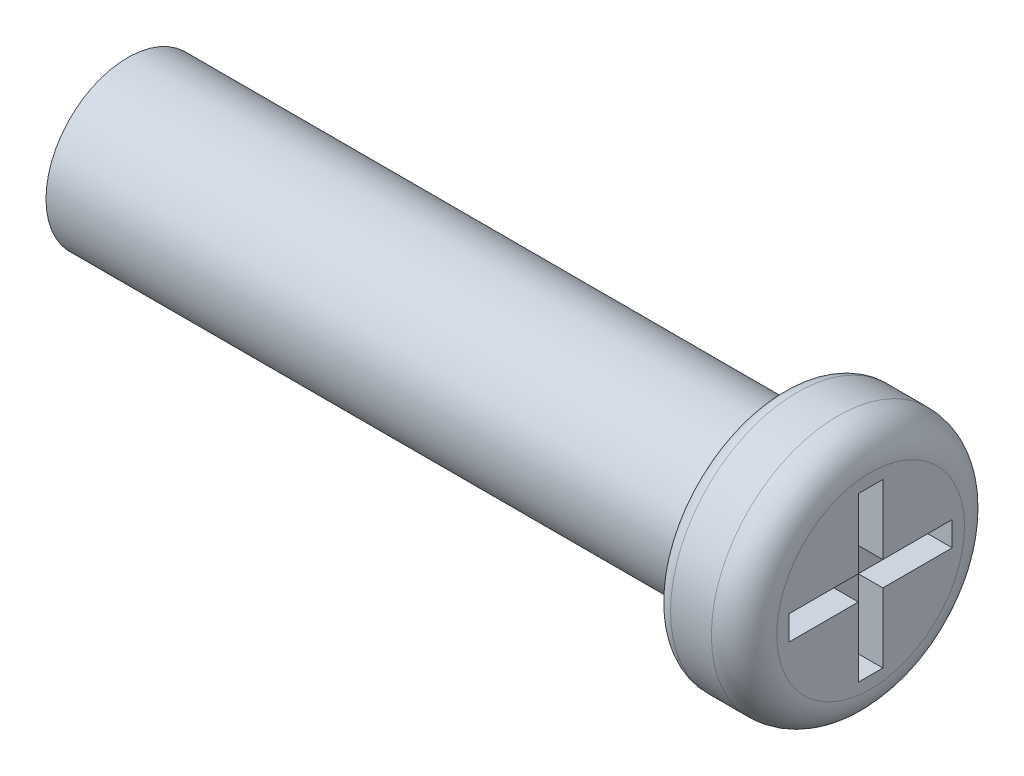
ISO-10303-21;
HEADER;
FILE_DESCRIPTION(('STEP AP214'),'2;1');
FILE_NAME('part.step','',(''),(''),'','','');
FILE_SCHEMA(('AUTOMOTIVE_DESIGN { 1 0 10303 214 1 1 1 1 }'));
ENDSEC;
DATA;
#1=APPLICATION_CONTEXT('core data for automotive mechanical design processes');
#2=APPLICATION_PROTOCOL_DEFINITION('international standard','automotive_design',2000,#1);
#3=PRODUCT_CONTEXT('',#1,'mechanical');
#4=PRODUCT('Part','Part','',(#3));
#5=PRODUCT_RELATED_PRODUCT_CATEGORY('part','',(#4));
#6=PRODUCT_DEFINITION_FORMATION('','',#4);
#7=PRODUCT_DEFINITION_CONTEXT('part definition',#1,'design');
#8=PRODUCT_DEFINITION('design','',#6,#7);
#9=PRODUCT_DEFINITION_SHAPE('','',#8);
#10=(LENGTH_UNIT() NAMED_UNIT(*) SI_UNIT(.MILLI.,.METRE.));
#11=(NAMED_UNIT(*) PLANE_ANGLE_UNIT() SI_UNIT($,.RADIAN.));
#12=(NAMED_UNIT(*) SI_UNIT($,.STERADIAN.) SOLID_ANGLE_UNIT());
#13=UNCERTAINTY_MEASURE_WITH_UNIT(LENGTH_MEASURE(1.E-05),#10,'distance_accuracy_value','');
#14=(GEOMETRIC_REPRESENTATION_CONTEXT(3) GLOBAL_UNCERTAINTY_ASSIGNED_CONTEXT((#13)) GLOBAL_UNIT_ASSIGNED_CONTEXT((#10,
#11,#12)) REPRESENTATION_CONTEXT('',''));
#15=CARTESIAN_POINT('',(0.,0.,0.));
#16=DIRECTION('',(0.,0.,1.));
#17=DIRECTION('',(1.,0.,0.));
#18=AXIS2_PLACEMENT_3D('',#15,#16,#17);
#19=CARTESIAN_POINT('',(26.1,0.,0.));
#20=DIRECTION('',(1.,0.,0.));
#21=DIRECTION('',(0.,0.,-1.));
#22=AXIS2_PLACEMENT_3D('',#19,#20,#21);
#23=PLANE('',#22);
#24=CARTESIAN_POINT('',(26.1,0.,0.));
#25=DIRECTION('',(1.,0.,0.));
#26=DIRECTION('',(0.,0.,-1.));
#27=AXIS2_PLACEMENT_3D('',#24,#25,#26);
#28=CIRCLE('',#27,1.15);
#29=CARTESIAN_POINT('',(26.1,0.,-1.15));
#30=VERTEX_POINT('',#29);
#31=EDGE_CURVE('E216',#30,#30,#28,.T.);
#32=ORIENTED_EDGE('',*,*,#31,.T.);
#33=EDGE_LOOP('',(#32));
#34=FACE_BOUND('',#33,.T.);
#35=DIRECTION('',(0.,-1.,0.));
#36=VECTOR('',#35,1.);
#37=CARTESIAN_POINT('',(26.1,0.,-1.));
#38=LINE('',#37,#36);
#39=CARTESIAN_POINT('',(26.1,0.15,-1.));
#40=VERTEX_POINT('',#39);
#41=CARTESIAN_POINT('',(26.1,-0.15,-1.));
#42=VERTEX_POINT('',#41);
#43=EDGE_CURVE('E162',#40,#42,#38,.T.);
#44=ORIENTED_EDGE('',*,*,#43,.T.);
#45=DIRECTION('',(0.,0.,1.));
#46=VECTOR('',#45,1.);
#47=CARTESIAN_POINT('',(26.1,-0.15,0.));
#48=LINE('',#47,#46);
#49=CARTESIAN_POINT('',(26.1,-0.15,-0.15));
#50=VERTEX_POINT('',#49);
#51=EDGE_CURVE('E49',#42,#50,#48,.T.);
#52=ORIENTED_EDGE('',*,*,#51,.T.);
#53=DIRECTION('',(0.,-1.,0.));
#54=VECTOR('',#53,1.);
#55=CARTESIAN_POINT('',(26.1,0.,-0.15));
#56=LINE('',#55,#54);
#57=CARTESIAN_POINT('',(26.1,-1.,-0.15));
#58=VERTEX_POINT('',#57);
#59=EDGE_CURVE('E99',#50,#58,#56,.T.);
#60=ORIENTED_EDGE('',*,*,#59,.T.);
#61=DIRECTION('',(0.,0.,1.));
#62=VECTOR('',#61,1.);
#63=CARTESIAN_POINT('',(26.1,-1.,0.));
#64=LINE('',#63,#62);
#65=CARTESIAN_POINT('',(26.1,-1.,0.15));
#66=VERTEX_POINT('',#65);
#67=EDGE_CURVE('E187',#58,#66,#64,.T.);
#68=ORIENTED_EDGE('',*,*,#67,.T.);
#69=DIRECTION('',(0.,-1.,0.));
#70=VECTOR('',#69,1.);
#71=CARTESIAN_POINT('',(26.1,0.,0.15));
#72=LINE('',#71,#70);
#73=CARTESIAN_POINT('',(26.1,-0.15,0.15));
#74=VERTEX_POINT('',#73);
#75=EDGE_CURVE('E146',#74,#66,#72,.T.);
#76=ORIENTED_EDGE('',*,*,#75,.F.);
#77=DIRECTION('',(0.,0.,1.));
#78=VECTOR('',#77,1.);
#79=CARTESIAN_POINT('',(26.1,-0.15,0.));
#80=LINE('',#79,#78);
#81=CARTESIAN_POINT('',(26.1,-0.15,1.));
#82=VERTEX_POINT('',#81);
#83=EDGE_CURVE('E183',#74,#82,#80,.T.);
#84=ORIENTED_EDGE('',*,*,#83,.T.);
#85=DIRECTION('',(0.,-1.,0.));
#86=VECTOR('',#85,1.);
#87=CARTESIAN_POINT('',(26.1,0.,1.));
#88=LINE('',#87,#86);
#89=CARTESIAN_POINT('',(26.1,0.15,1.));
#90=VERTEX_POINT('',#89);
#91=EDGE_CURVE('E180',#90,#82,#88,.T.);
#92=ORIENTED_EDGE('',*,*,#91,.F.);
#93=DIRECTION('',(0.,0.,1.));
#94=VECTOR('',#93,1.);
#95=CARTESIAN_POINT('',(26.1,0.15,0.));
#96=LINE('',#95,#94);
#97=CARTESIAN_POINT('',(26.1,0.15,0.15));
#98=VERTEX_POINT('',#97);
#99=EDGE_CURVE('E177',#98,#90,#96,.T.);
#100=ORIENTED_EDGE('',*,*,#99,.F.);
#101=DIRECTION('',(0.,-1.,0.));
#102=VECTOR('',#101,1.);
#103=CARTESIAN_POINT('',(26.1,0.,0.15));
#104=LINE('',#103,#102);
#105=CARTESIAN_POINT('',(26.1,1.,0.15));
#106=VERTEX_POINT('',#105);
#107=EDGE_CURVE('E174',#106,#98,#104,.T.);
#108=ORIENTED_EDGE('',*,*,#107,.F.);
#109=DIRECTION('',(0.,0.,1.));
#110=VECTOR('',#109,1.);
#111=CARTESIAN_POINT('',(26.1,1.,0.));
#112=LINE('',#111,#110);
#113=CARTESIAN_POINT('',(26.1,1.,-0.15));
#114=VERTEX_POINT('',#113);
#115=EDGE_CURVE('E171',#114,#106,#112,.T.);
#116=ORIENTED_EDGE('',*,*,#115,.F.);
#117=DIRECTION('',(0.,-1.,0.));
#118=VECTOR('',#117,1.);
#119=CARTESIAN_POINT('',(26.1,0.,-0.15));
#120=LINE('',#119,#118);
#121=CARTESIAN_POINT('',(26.1,0.15,-0.15));
#122=VERTEX_POINT('',#121);
#123=EDGE_CURVE('E168',#114,#122,#120,.T.);
#124=ORIENTED_EDGE('',*,*,#123,.T.);
#125=DIRECTION('',(0.,0.,1.));
#126=VECTOR('',#125,1.);
#127=CARTESIAN_POINT('',(26.1,0.15,0.));
#128=LINE('',#127,#126);
#129=EDGE_CURVE('E165',#40,#122,#128,.T.);
#130=ORIENTED_EDGE('',*,*,#129,.F.);
#131=EDGE_LOOP('',(#44,#52,#60,#68,#76,#84,#92,#100,#108,#116,#124,#130));
#132=FACE_BOUND('',#131,.T.);
#133=ADVANCED_FACE('F34',(#34,#132),#23,.T.);
#134=CARTESIAN_POINT('',(25.,0.,0.));
#135=DIRECTION('',(-1.,0.,0.));
#136=DIRECTION('',(0.,0.,1.));
#137=AXIS2_PLACEMENT_3D('',#134,#135,#136);
#138=CYLINDRICAL_SURFACE('',#137,1.);
#139=CARTESIAN_POINT('',(25.,0.,0.));
#140=DIRECTION('',(1.,0.,0.));
#141=DIRECTION('',(0.,0.,-1.));
#142=AXIS2_PLACEMENT_3D('',#139,#140,#141);
#143=CIRCLE('',#142,1.);
#144=CARTESIAN_POINT('',(25.,0.,-1.));
#145=VERTEX_POINT('',#144);
#146=EDGE_CURVE('E213',#145,#145,#143,.T.);
#147=ORIENTED_EDGE('',*,*,#146,.F.);
#148=EDGE_LOOP('',(#147));
#149=FACE_BOUND('',#148,.T.);
#150=CARTESIAN_POINT('',(17.,0.,0.));
#151=DIRECTION('',(-1.,0.,0.));
#152=DIRECTION('',(0.,0.,1.));
#153=AXIS2_PLACEMENT_3D('',#150,#151,#152);
#154=CIRCLE('',#153,1.);
#155=CARTESIAN_POINT('',(17.,0.,1.));
#156=VERTEX_POINT('',#155);
#157=EDGE_CURVE('E193',#156,#156,#154,.T.);
#158=ORIENTED_EDGE('',*,*,#157,.F.);
#159=EDGE_LOOP('',(#158));
#160=FACE_BOUND('',#159,.T.);
#161=ADVANCED_FACE('F236',(#149,#160),#138,.T.);
#162=CARTESIAN_POINT('',(26.1,0.,0.));
#163=DIRECTION('',(-1.,0.,0.));
#164=DIRECTION('',(0.,0.,1.));
#165=AXIS2_PLACEMENT_3D('',#162,#163,#164);
#166=CYLINDRICAL_SURFACE('',#165,1.55);
#167=CARTESIAN_POINT('',(25.2,0.,0.));
#168=DIRECTION('',(1.,0.,0.));
#169=DIRECTION('',(0.,0.,-1.));
#170=AXIS2_PLACEMENT_3D('',#167,#168,#169);
#171=CIRCLE('',#170,1.55);
#172=CARTESIAN_POINT('',(25.2,0.,-1.55));
#173=VERTEX_POINT('',#172);
#174=EDGE_CURVE('E42',#173,#173,#171,.T.);
#175=ORIENTED_EDGE('',*,*,#174,.T.);
#176=EDGE_LOOP('',(#175));
#177=FACE_BOUND('',#176,.T.);
#178=CARTESIAN_POINT('',(25.7,0.,0.));
#179=DIRECTION('',(1.,0.,0.));
#180=DIRECTION('',(0.,0.,-1.));
#181=AXIS2_PLACEMENT_3D('',#178,#179,#180);
#182=CIRCLE('',#181,1.55);
#183=CARTESIAN_POINT('',(25.7,0.,-1.55));
#184=VERTEX_POINT('',#183);
#185=EDGE_CURVE('E219',#184,#184,#182,.F.);
#186=ORIENTED_EDGE('',*,*,#185,.T.);
#187=EDGE_LOOP('',(#186));
#188=FACE_BOUND('',#187,.T.);
#189=ADVANCED_FACE('F224',(#177,#188),#166,.T.);
#190=CARTESIAN_POINT('',(25.,0.,0.));
#191=DIRECTION('',(1.,0.,0.));
#192=DIRECTION('',(0.,0.,-1.));
#193=AXIS2_PLACEMENT_3D('',#190,#191,#192);
#194=PLANE('',#193);
#195=CARTESIAN_POINT('',(25.,0.,0.));
#196=DIRECTION('',(1.,0.,0.));
#197=DIRECTION('',(0.,0.,-1.));
#198=AXIS2_PLACEMENT_3D('',#195,#196,#197);
#199=CIRCLE('',#198,1.35);
#200=CARTESIAN_POINT('',(25.,0.,-1.35));
#201=VERTEX_POINT('',#200);
#202=EDGE_CURVE('E11',#201,#201,#199,.F.);
#203=ORIENTED_EDGE('',*,*,#202,.T.);
#204=EDGE_LOOP('',(#203));
#205=FACE_BOUND('',#204,.T.);
#206=ORIENTED_EDGE('',*,*,#146,.T.);
#207=EDGE_LOOP('',(#206));
#208=FACE_BOUND('',#207,.T.);
#209=ADVANCED_FACE('F249',(#205,#208),#194,.F.);
#210=CARTESIAN_POINT('',(17.,0.,0.));
#211=DIRECTION('',(-1.,0.,0.));
#212=DIRECTION('',(0.,0.,1.));
#213=AXIS2_PLACEMENT_3D('',#210,#211,#212);
#214=PLANE('',#213);
#215=ORIENTED_EDGE('',*,*,#157,.T.);
#216=EDGE_LOOP('',(#215));
#217=FACE_BOUND('',#216,.T.);
#218=ADVANCED_FACE('F247',(#217),#214,.T.);
#219=CARTESIAN_POINT('',(25.8,-0.15,0.));
#220=DIRECTION('',(0.,1.,0.));
#221=DIRECTION('',(0.,0.,1.));
#222=AXIS2_PLACEMENT_3D('',#219,#220,#221);
#223=PLANE('',#222);
#224=ORIENTED_EDGE('',*,*,#51,.F.);
#225=DIRECTION('',(1.,0.,0.));
#226=VECTOR('',#225,1.);
#227=CARTESIAN_POINT('',(25.8,-0.15,-1.));
#228=LINE('',#227,#226);
#229=CARTESIAN_POINT('',(25.8,-0.15,-1.));
#230=VERTEX_POINT('',#229);
#231=EDGE_CURVE('E160',#230,#42,#228,.T.);
#232=ORIENTED_EDGE('',*,*,#231,.F.);
#233=DIRECTION('',(0.,0.,1.));
#234=VECTOR('',#233,1.);
#235=CARTESIAN_POINT('',(25.8,-0.15,0.));
#236=LINE('',#235,#234);
#237=CARTESIAN_POINT('',(25.8,-0.15,-0.15));
#238=VERTEX_POINT('',#237);
#239=EDGE_CURVE('E190',#230,#238,#236,.T.);
#240=ORIENTED_EDGE('',*,*,#239,.T.);
#241=DIRECTION('',(1.,0.,0.));
#242=VECTOR('',#241,1.);
#243=CARTESIAN_POINT('',(25.8,-0.15,-0.15));
#244=LINE('',#243,#242);
#245=EDGE_CURVE('E191',#238,#50,#244,.T.);
#246=ORIENTED_EDGE('',*,*,#245,.T.);
#247=EDGE_LOOP('',(#224,#232,#240,#246));
#248=FACE_BOUND('',#247,.T.);
#249=ADVANCED_FACE('F269',(#248),#223,.T.);
#250=CARTESIAN_POINT('',(25.8,0.,-0.15));
#251=DIRECTION('',(0.,0.,1.));
#252=DIRECTION('',(0.,-1.,0.));
#253=AXIS2_PLACEMENT_3D('',#250,#251,#252);
#254=PLANE('',#253);
#255=ORIENTED_EDGE('',*,*,#59,.F.);
#256=ORIENTED_EDGE('',*,*,#245,.F.);
#257=DIRECTION('',(0.,-1.,0.));
#258=VECTOR('',#257,1.);
#259=CARTESIAN_POINT('',(25.8,0.,-0.15));
#260=LINE('',#259,#258);
#261=CARTESIAN_POINT('',(25.8,-1.,-0.15));
#262=VERTEX_POINT('',#261);
#263=EDGE_CURVE('E58',#238,#262,#260,.T.);
#264=ORIENTED_EDGE('',*,*,#263,.T.);
#265=DIRECTION('',(1.,0.,0.));
#266=VECTOR('',#265,1.);
#267=CARTESIAN_POINT('',(25.8,-1.,-0.15));
#268=LINE('',#267,#266);
#269=EDGE_CURVE('E138',#262,#58,#268,.T.);
#270=ORIENTED_EDGE('',*,*,#269,.T.);
#271=EDGE_LOOP('',(#255,#256,#264,#270));
#272=FACE_BOUND('',#271,.T.);
#273=ADVANCED_FACE('F276',(#272),#254,.T.);
#274=CARTESIAN_POINT('',(25.8,-1.,0.));
#275=DIRECTION('',(0.,1.,0.));
#276=DIRECTION('',(0.,0.,1.));
#277=AXIS2_PLACEMENT_3D('',#274,#275,#276);
#278=PLANE('',#277);
#279=ORIENTED_EDGE('',*,*,#67,.F.);
#280=ORIENTED_EDGE('',*,*,#269,.F.);
#281=DIRECTION('',(0.,0.,1.));
#282=VECTOR('',#281,1.);
#283=CARTESIAN_POINT('',(25.8,-1.,0.));
#284=LINE('',#283,#282);
#285=CARTESIAN_POINT('',(25.8,-1.,0.15));
#286=VERTEX_POINT('',#285);
#287=EDGE_CURVE('E132',#262,#286,#284,.T.);
#288=ORIENTED_EDGE('',*,*,#287,.T.);
#289=DIRECTION('',(1.,0.,0.));
#290=VECTOR('',#289,1.);
#291=CARTESIAN_POINT('',(25.8,-1.,0.15));
#292=LINE('',#291,#290);
#293=EDGE_CURVE('E136',#286,#66,#292,.T.);
#294=ORIENTED_EDGE('',*,*,#293,.T.);
#295=EDGE_LOOP('',(#279,#280,#288,#294));
#296=FACE_BOUND('',#295,.T.);
#297=ADVANCED_FACE('F135',(#296),#278,.T.);
#298=CARTESIAN_POINT('',(25.8,0.,0.15));
#299=DIRECTION('',(0.,0.,1.));
#300=DIRECTION('',(0.,-1.,0.));
#301=AXIS2_PLACEMENT_3D('',#298,#299,#300);
#302=PLANE('',#301);
#303=ORIENTED_EDGE('',*,*,#75,.T.);
#304=ORIENTED_EDGE('',*,*,#293,.F.);
#305=DIRECTION('',(0.,-1.,0.));
#306=VECTOR('',#305,1.);
#307=CARTESIAN_POINT('',(25.8,0.,0.15));
#308=LINE('',#307,#306);
#309=CARTESIAN_POINT('',(25.8,-0.15,0.15));
#310=VERTEX_POINT('',#309);
#311=EDGE_CURVE('E140',#310,#286,#308,.T.);
#312=ORIENTED_EDGE('',*,*,#311,.F.);
#313=DIRECTION('',(1.,0.,0.));
#314=VECTOR('',#313,1.);
#315=CARTESIAN_POINT('',(25.8,-0.15,0.15));
#316=LINE('',#315,#314);
#317=EDGE_CURVE('E148',#310,#74,#316,.T.);
#318=ORIENTED_EDGE('',*,*,#317,.T.);
#319=EDGE_LOOP('',(#303,#304,#312,#318));
#320=FACE_BOUND('',#319,.T.);
#321=ADVANCED_FACE('F144',(#320),#302,.F.);
#322=CARTESIAN_POINT('',(25.8,-0.15,0.));
#323=DIRECTION('',(0.,1.,0.));
#324=DIRECTION('',(0.,0.,1.));
#325=AXIS2_PLACEMENT_3D('',#322,#323,#324);
#326=PLANE('',#325);
#327=ORIENTED_EDGE('',*,*,#83,.F.);
#328=ORIENTED_EDGE('',*,*,#317,.F.);
#329=DIRECTION('',(0.,0.,1.));
#330=VECTOR('',#329,1.);
#331=CARTESIAN_POINT('',(25.8,-0.15,0.));
#332=LINE('',#331,#330);
#333=CARTESIAN_POINT('',(25.8,-0.15,1.));
#334=VERTEX_POINT('',#333);
#335=EDGE_CURVE('E153',#310,#334,#332,.T.);
#336=ORIENTED_EDGE('',*,*,#335,.T.);
#337=DIRECTION('',(1.,0.,0.));
#338=VECTOR('',#337,1.);
#339=CARTESIAN_POINT('',(25.8,-0.15,1.));
#340=LINE('',#339,#338);
#341=EDGE_CURVE('E196',#334,#82,#340,.T.);
#342=ORIENTED_EDGE('',*,*,#341,.T.);
#343=EDGE_LOOP('',(#327,#328,#336,#342));
#344=FACE_BOUND('',#343,.T.);
#345=ADVANCED_FACE('F294',(#344),#326,.T.);
#346=CARTESIAN_POINT('',(25.8,0.,1.));
#347=DIRECTION('',(0.,0.,1.));
#348=DIRECTION('',(1.,0.,0.));
#349=AXIS2_PLACEMENT_3D('',#346,#347,#348);
#350=PLANE('',#349);
#351=ORIENTED_EDGE('',*,*,#91,.T.);
#352=ORIENTED_EDGE('',*,*,#341,.F.);
#353=DIRECTION('',(0.,-1.,0.));
#354=VECTOR('',#353,1.);
#355=CARTESIAN_POINT('',(25.8,0.,1.));
#356=LINE('',#355,#354);
#357=CARTESIAN_POINT('',(25.8,0.15,1.));
#358=VERTEX_POINT('',#357);
#359=EDGE_CURVE('E155',#358,#334,#356,.T.);
#360=ORIENTED_EDGE('',*,*,#359,.F.);
#361=DIRECTION('',(1.,0.,0.));
#362=VECTOR('',#361,1.);
#363=CARTESIAN_POINT('',(25.8,0.15,1.));
#364=LINE('',#363,#362);
#365=EDGE_CURVE('E198',#358,#90,#364,.T.);
#366=ORIENTED_EDGE('',*,*,#365,.T.);
#367=EDGE_LOOP('',(#351,#352,#360,#366));
#368=FACE_BOUND('',#367,.T.);
#369=ADVANCED_FACE('F301',(#368),#350,.F.);
#370=CARTESIAN_POINT('',(25.8,0.15,0.));
#371=DIRECTION('',(0.,1.,0.));
#372=DIRECTION('',(0.,0.,1.));
#373=AXIS2_PLACEMENT_3D('',#370,#371,#372);
#374=PLANE('',#373);
#375=ORIENTED_EDGE('',*,*,#99,.T.);
#376=ORIENTED_EDGE('',*,*,#365,.F.);
#377=DIRECTION('',(0.,0.,1.));
#378=VECTOR('',#377,1.);
#379=CARTESIAN_POINT('',(25.8,0.15,0.));
#380=LINE('',#379,#378);
#381=CARTESIAN_POINT('',(25.8,0.15,0.15));
#382=VERTEX_POINT('',#381);
#383=EDGE_CURVE('E444',#382,#358,#380,.T.);
#384=ORIENTED_EDGE('',*,*,#383,.F.);
#385=DIRECTION('',(1.,0.,0.));
#386=VECTOR('',#385,1.);
#387=CARTESIAN_POINT('',(25.8,0.15,0.15));
#388=LINE('',#387,#386);
#389=EDGE_CURVE('E200',#382,#98,#388,.T.);
#390=ORIENTED_EDGE('',*,*,#389,.T.);
#391=EDGE_LOOP('',(#375,#376,#384,#390));
#392=FACE_BOUND('',#391,.T.);
#393=ADVANCED_FACE('F309',(#392),#374,.F.);
#394=CARTESIAN_POINT('',(25.8,0.,0.15));
#395=DIRECTION('',(0.,0.,1.));
#396=DIRECTION('',(0.,-1.,0.));
#397=AXIS2_PLACEMENT_3D('',#394,#395,#396);
#398=PLANE('',#397);
#399=ORIENTED_EDGE('',*,*,#107,.T.);
#400=ORIENTED_EDGE('',*,*,#389,.F.);
#401=DIRECTION('',(0.,-1.,0.));
#402=VECTOR('',#401,1.);
#403=CARTESIAN_POINT('',(25.8,0.,0.15));
#404=LINE('',#403,#402);
#405=CARTESIAN_POINT('',(25.8,1.,0.15));
#406=VERTEX_POINT('',#405);
#407=EDGE_CURVE('E441',#406,#382,#404,.T.);
#408=ORIENTED_EDGE('',*,*,#407,.F.);
#409=DIRECTION('',(1.,0.,0.));
#410=VECTOR('',#409,1.);
#411=CARTESIAN_POINT('',(25.8,1.,0.15));
#412=LINE('',#411,#410);
#413=EDGE_CURVE('E202',#406,#106,#412,.T.);
#414=ORIENTED_EDGE('',*,*,#413,.T.);
#415=EDGE_LOOP('',(#399,#400,#408,#414));
#416=FACE_BOUND('',#415,.T.);
#417=ADVANCED_FACE('F317',(#416),#398,.F.);
#418=CARTESIAN_POINT('',(25.8,1.,0.));
#419=DIRECTION('',(0.,1.,0.));
#420=DIRECTION('',(0.,0.,1.));
#421=AXIS2_PLACEMENT_3D('',#418,#419,#420);
#422=PLANE('',#421);
#423=ORIENTED_EDGE('',*,*,#115,.T.);
#424=ORIENTED_EDGE('',*,*,#413,.F.);
#425=DIRECTION('',(0.,0.,1.));
#426=VECTOR('',#425,1.);
#427=CARTESIAN_POINT('',(25.8,1.,0.));
#428=LINE('',#427,#426);
#429=CARTESIAN_POINT('',(25.8,1.,-0.15));
#430=VERTEX_POINT('',#429);
#431=EDGE_CURVE('E434',#430,#406,#428,.T.);
#432=ORIENTED_EDGE('',*,*,#431,.F.);
#433=DIRECTION('',(1.,0.,0.));
#434=VECTOR('',#433,1.);
#435=CARTESIAN_POINT('',(25.8,1.,-0.15));
#436=LINE('',#435,#434);
#437=EDGE_CURVE('E204',#430,#114,#436,.T.);
#438=ORIENTED_EDGE('',*,*,#437,.T.);
#439=EDGE_LOOP('',(#423,#424,#432,#438));
#440=FACE_BOUND('',#439,.T.);
#441=ADVANCED_FACE('F325',(#440),#422,.F.);
#442=CARTESIAN_POINT('',(25.8,0.,-0.15));
#443=DIRECTION('',(0.,0.,1.));
#444=DIRECTION('',(0.,-1.,0.));
#445=AXIS2_PLACEMENT_3D('',#442,#443,#444);
#446=PLANE('',#445);
#447=ORIENTED_EDGE('',*,*,#123,.F.);
#448=ORIENTED_EDGE('',*,*,#437,.F.);
#449=DIRECTION('',(0.,-1.,0.));
#450=VECTOR('',#449,1.);
#451=CARTESIAN_POINT('',(25.8,0.,-0.15));
#452=LINE('',#451,#450);
#453=CARTESIAN_POINT('',(25.8,0.15,-0.15));
#454=VERTEX_POINT('',#453);
#455=EDGE_CURVE('E432',#430,#454,#452,.T.);
#456=ORIENTED_EDGE('',*,*,#455,.T.);
#457=DIRECTION('',(1.,0.,0.));
#458=VECTOR('',#457,1.);
#459=CARTESIAN_POINT('',(25.8,0.15,-0.15));
#460=LINE('',#459,#458);
#461=EDGE_CURVE('E206',#454,#122,#460,.T.);
#462=ORIENTED_EDGE('',*,*,#461,.T.);
#463=EDGE_LOOP('',(#447,#448,#456,#462));
#464=FACE_BOUND('',#463,.T.);
#465=ADVANCED_FACE('F333',(#464),#446,.T.);
#466=CARTESIAN_POINT('',(25.8,0.15,0.));
#467=DIRECTION('',(0.,1.,0.));
#468=DIRECTION('',(0.,0.,1.));
#469=AXIS2_PLACEMENT_3D('',#466,#467,#468);
#470=PLANE('',#469);
#471=ORIENTED_EDGE('',*,*,#129,.T.);
#472=ORIENTED_EDGE('',*,*,#461,.F.);
#473=DIRECTION('',(0.,0.,1.));
#474=VECTOR('',#473,1.);
#475=CARTESIAN_POINT('',(25.8,0.15,0.));
#476=LINE('',#475,#474);
#477=CARTESIAN_POINT('',(25.8,0.15,-1.));
#478=VERTEX_POINT('',#477);
#479=EDGE_CURVE('E430',#478,#454,#476,.T.);
#480=ORIENTED_EDGE('',*,*,#479,.F.);
#481=DIRECTION('',(1.,0.,0.));
#482=VECTOR('',#481,1.);
#483=CARTESIAN_POINT('',(25.8,0.15,-1.));
#484=LINE('',#483,#482);
#485=EDGE_CURVE('E208',#478,#40,#484,.T.);
#486=ORIENTED_EDGE('',*,*,#485,.T.);
#487=EDGE_LOOP('',(#471,#472,#480,#486));
#488=FACE_BOUND('',#487,.T.);
#489=ADVANCED_FACE('F341',(#488),#470,.F.);
#490=CARTESIAN_POINT('',(25.8,0.,-1.));
#491=DIRECTION('',(0.,0.,1.));
#492=DIRECTION('',(1.,0.,0.));
#493=AXIS2_PLACEMENT_3D('',#490,#491,#492);
#494=PLANE('',#493);
#495=ORIENTED_EDGE('',*,*,#43,.F.);
#496=ORIENTED_EDGE('',*,*,#485,.F.);
#497=DIRECTION('',(0.,-1.,0.));
#498=VECTOR('',#497,1.);
#499=CARTESIAN_POINT('',(25.8,0.,-1.));
#500=LINE('',#499,#498);
#501=EDGE_CURVE('E106',#478,#230,#500,.T.);
#502=ORIENTED_EDGE('',*,*,#501,.T.);
#503=ORIENTED_EDGE('',*,*,#231,.T.);
#504=EDGE_LOOP('',(#495,#496,#502,#503));
#505=FACE_BOUND('',#504,.T.);
#506=ADVANCED_FACE('F349',(#505),#494,.T.);
#507=CARTESIAN_POINT('',(25.8,0.,0.));
#508=DIRECTION('',(1.,0.,0.));
#509=DIRECTION('',(0.,0.,-1.));
#510=AXIS2_PLACEMENT_3D('',#507,#508,#509);
#511=PLANE('',#510);
#512=ORIENTED_EDGE('',*,*,#239,.F.);
#513=ORIENTED_EDGE('',*,*,#501,.F.);
#514=ORIENTED_EDGE('',*,*,#479,.T.);
#515=ORIENTED_EDGE('',*,*,#455,.F.);
#516=ORIENTED_EDGE('',*,*,#431,.T.);
#517=ORIENTED_EDGE('',*,*,#407,.T.);
#518=ORIENTED_EDGE('',*,*,#383,.T.);
#519=ORIENTED_EDGE('',*,*,#359,.T.);
#520=ORIENTED_EDGE('',*,*,#335,.F.);
#521=ORIENTED_EDGE('',*,*,#311,.T.);
#522=ORIENTED_EDGE('',*,*,#287,.F.);
#523=ORIENTED_EDGE('',*,*,#263,.F.);
#524=EDGE_LOOP('',(#512,#513,#514,#515,#516,#517,#518,#519,#520,#521,#522,#523));
#525=FACE_BOUND('',#524,.T.);
#526=ADVANCED_FACE('F151',(#525),#511,.T.);
#527=CARTESIAN_POINT('',(25.7,0.,0.));
#528=DIRECTION('',(1.,0.,0.));
#529=DIRECTION('',(0.,0.,-1.));
#530=AXIS2_PLACEMENT_3D('',#527,#528,#529);
#531=TOROIDAL_SURFACE('',#530,1.15,0.4);
#532=ORIENTED_EDGE('',*,*,#185,.F.);
#533=EDGE_LOOP('',(#532));
#534=FACE_BOUND('',#533,.T.);
#535=ORIENTED_EDGE('',*,*,#31,.F.);
#536=EDGE_LOOP('',(#535));
#537=FACE_BOUND('',#536,.T.);
#538=ADVANCED_FACE('F228',(#534,#537),#531,.T.);
#539=CARTESIAN_POINT('',(25.2,0.,0.));
#540=DIRECTION('',(1.,0.,0.));
#541=DIRECTION('',(0.,0.,-1.));
#542=AXIS2_PLACEMENT_3D('',#539,#540,#541);
#543=TOROIDAL_SURFACE('',#542,1.35,0.2);
#544=ORIENTED_EDGE('',*,*,#202,.F.);
#545=EDGE_LOOP('',(#544));
#546=FACE_BOUND('',#545,.T.);
#547=ORIENTED_EDGE('',*,*,#174,.F.);
#548=EDGE_LOOP('',(#547));
#549=FACE_BOUND('',#548,.T.);
#550=ADVANCED_FACE('F36',(#546,#549),#543,.T.);
#551=CLOSED_SHELL('',(#133,#161,#189,#209,#218,#249,#273,#297,#321,#345,#369,#393,#417,#441,
#465,#489,#506,#526,#538,#550));
#552=MANIFOLD_SOLID_BREP('B2',#551);
#553=ADVANCED_BREP_SHAPE_REPRESENTATION('',(#18,#552),#14);
#554=SHAPE_DEFINITION_REPRESENTATION(#9,#553);
ENDSEC;
END-ISO-10303-21;
